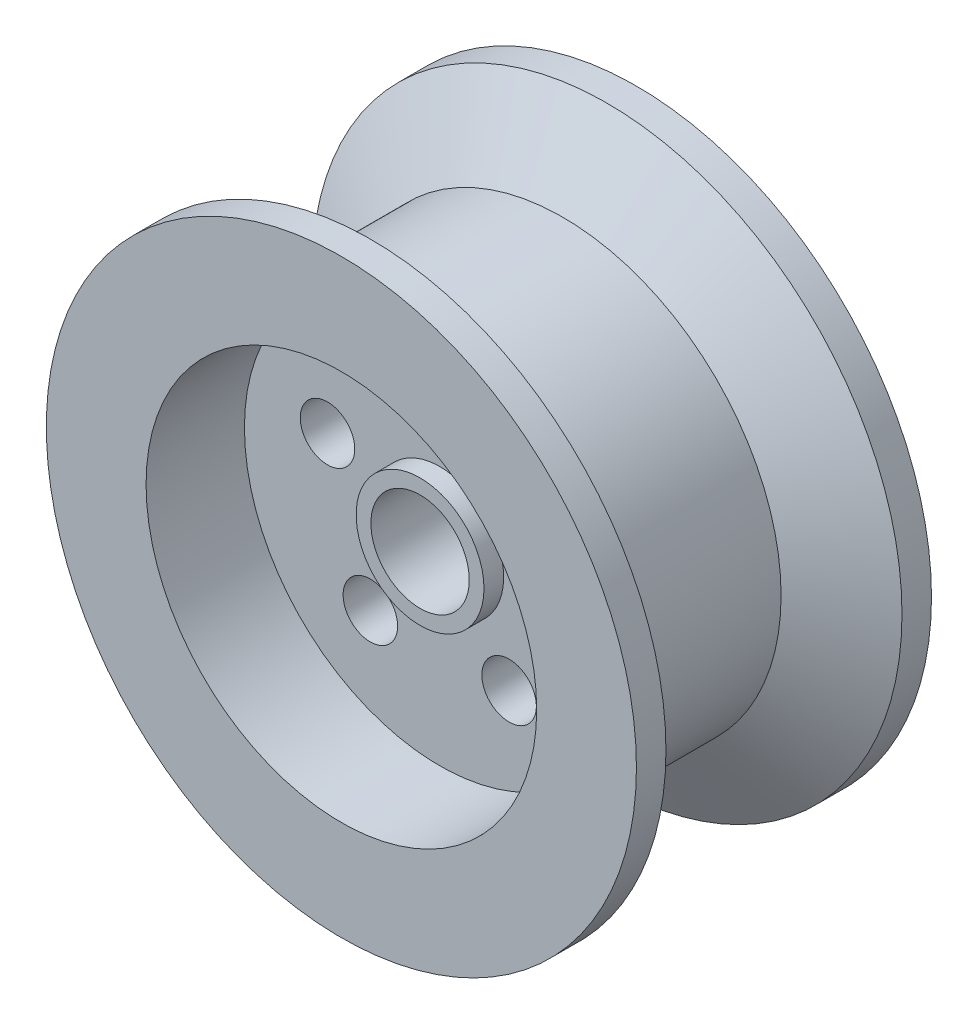
ISO-10303-21;
HEADER;
FILE_DESCRIPTION(('STEP AP214'),'2;1');
FILE_NAME('part.step','',(''),(''),'','','');
FILE_SCHEMA(('AUTOMOTIVE_DESIGN { 1 0 10303 214 1 1 1 1 }'));
ENDSEC;
DATA;
#1=APPLICATION_CONTEXT('core data for automotive mechanical design processes');
#2=APPLICATION_PROTOCOL_DEFINITION('international standard','automotive_design',2000,#1);
#3=PRODUCT_CONTEXT('',#1,'mechanical');
#4=PRODUCT('Part','Part','',(#3));
#5=PRODUCT_RELATED_PRODUCT_CATEGORY('part','',(#4));
#6=PRODUCT_DEFINITION_FORMATION('','',#4);
#7=PRODUCT_DEFINITION_CONTEXT('part definition',#1,'design');
#8=PRODUCT_DEFINITION('design','',#6,#7);
#9=PRODUCT_DEFINITION_SHAPE('','',#8);
#10=(LENGTH_UNIT() NAMED_UNIT(*) SI_UNIT(.MILLI.,.METRE.));
#11=(NAMED_UNIT(*) PLANE_ANGLE_UNIT() SI_UNIT($,.RADIAN.));
#12=(NAMED_UNIT(*) SI_UNIT($,.STERADIAN.) SOLID_ANGLE_UNIT());
#13=UNCERTAINTY_MEASURE_WITH_UNIT(LENGTH_MEASURE(1.E-05),#10,'distance_accuracy_value','');
#14=(GEOMETRIC_REPRESENTATION_CONTEXT(3) GLOBAL_UNCERTAINTY_ASSIGNED_CONTEXT((#13)) GLOBAL_UNIT_ASSIGNED_CONTEXT((#10,
#11,#12)) REPRESENTATION_CONTEXT('',''));
#15=CARTESIAN_POINT('',(0.,0.,0.));
#16=DIRECTION('',(0.,0.,1.));
#17=DIRECTION('',(1.,0.,0.));
#18=AXIS2_PLACEMENT_3D('',#15,#16,#17);
#19=CARTESIAN_POINT('',(0.,0.,30.));
#20=DIRECTION('',(0.,0.,-1.));
#21=DIRECTION('',(-1.,0.,0.));
#22=AXIS2_PLACEMENT_3D('',#19,#20,#21);
#23=CYLINDRICAL_SURFACE('',#22,30.);
#24=CARTESIAN_POINT('',(0.,0.,3.));
#25=DIRECTION('',(0.,0.,1.));
#26=DIRECTION('',(1.,0.,0.));
#27=AXIS2_PLACEMENT_3D('',#24,#25,#26);
#28=CIRCLE('',#27,30.);
#29=CARTESIAN_POINT('',(30.,0.,3.));
#30=VERTEX_POINT('',#29);
#31=EDGE_CURVE('E95',#30,#30,#28,.T.);
#32=ORIENTED_EDGE('',*,*,#31,.F.);
#33=EDGE_LOOP('',(#32));
#34=FACE_BOUND('',#33,.T.);
#35=CARTESIAN_POINT('',(0.,0.,0.));
#36=DIRECTION('',(0.,0.,1.));
#37=DIRECTION('',(1.,0.,0.));
#38=AXIS2_PLACEMENT_3D('',#35,#36,#37);
#39=CIRCLE('',#38,30.);
#40=CARTESIAN_POINT('',(30.,0.,0.));
#41=VERTEX_POINT('',#40);
#42=EDGE_CURVE('E44',#41,#41,#39,.T.);
#43=ORIENTED_EDGE('',*,*,#42,.T.);
#44=EDGE_LOOP('',(#43));
#45=FACE_BOUND('',#44,.T.);
#46=ADVANCED_FACE('F33',(#34,#45),#23,.T.);
#47=CARTESIAN_POINT('',(0.,0.,30.));
#48=DIRECTION('',(0.,0.,-1.));
#49=DIRECTION('',(-1.,0.,0.));
#50=AXIS2_PLACEMENT_3D('',#47,#48,#49);
#51=CYLINDRICAL_SURFACE('',#50,5.);
#52=CARTESIAN_POINT('',(0.,0.,22.));
#53=DIRECTION('',(0.,0.,1.));
#54=DIRECTION('',(1.,0.,0.));
#55=AXIS2_PLACEMENT_3D('',#52,#53,#54);
#56=CIRCLE('',#55,5.);
#57=CARTESIAN_POINT('',(5.,0.,22.));
#58=VERTEX_POINT('',#57);
#59=EDGE_CURVE('E92',#58,#58,#56,.T.);
#60=ORIENTED_EDGE('',*,*,#59,.T.);
#61=EDGE_LOOP('',(#60));
#62=FACE_BOUND('',#61,.T.);
#63=CARTESIAN_POINT('',(0.,0.,0.));
#64=DIRECTION('',(0.,0.,1.));
#65=DIRECTION('',(1.,0.,0.));
#66=AXIS2_PLACEMENT_3D('',#63,#64,#65);
#67=CIRCLE('',#66,5.);
#68=CARTESIAN_POINT('',(5.,0.,0.));
#69=VERTEX_POINT('',#68);
#70=EDGE_CURVE('E49',#69,#69,#67,.T.);
#71=ORIENTED_EDGE('',*,*,#70,.F.);
#72=EDGE_LOOP('',(#71));
#73=FACE_BOUND('',#72,.T.);
#74=ADVANCED_FACE('F131',(#62,#73),#51,.F.);
#75=CARTESIAN_POINT('',(0.,0.,30.));
#76=DIRECTION('',(0.,0.,1.));
#77=DIRECTION('',(1.,0.,0.));
#78=AXIS2_PLACEMENT_3D('',#75,#76,#77);
#79=PLANE('',#78);
#80=CARTESIAN_POINT('',(0.,0.,30.));
#81=DIRECTION('',(0.,0.,1.));
#82=DIRECTION('',(1.,0.,0.));
#83=AXIS2_PLACEMENT_3D('',#80,#81,#82);
#84=CIRCLE('',#83,19.858143103124);
#85=CARTESIAN_POINT('',(19.858143103124,0.,30.));
#86=VERTEX_POINT('',#85);
#87=EDGE_CURVE('E54',#86,#86,#84,.T.);
#88=ORIENTED_EDGE('',*,*,#87,.F.);
#89=EDGE_LOOP('',(#88));
#90=FACE_BOUND('',#89,.T.);
#91=CARTESIAN_POINT('',(0.,0.,30.));
#92=DIRECTION('',(0.,0.,1.));
#93=DIRECTION('',(1.,0.,0.));
#94=AXIS2_PLACEMENT_3D('',#91,#92,#93);
#95=CIRCLE('',#94,30.);
#96=CARTESIAN_POINT('',(30.,0.,30.));
#97=VERTEX_POINT('',#96);
#98=EDGE_CURVE('E40',#97,#97,#95,.T.);
#99=ORIENTED_EDGE('',*,*,#98,.T.);
#100=EDGE_LOOP('',(#99));
#101=FACE_BOUND('',#100,.T.);
#102=ADVANCED_FACE('F137',(#90,#101),#79,.T.);
#103=CARTESIAN_POINT('',(0.,0.,0.));
#104=DIRECTION('',(0.,0.,1.));
#105=DIRECTION('',(1.,0.,0.));
#106=AXIS2_PLACEMENT_3D('',#103,#104,#105);
#107=PLANE('',#106);
#108=CARTESIAN_POINT('',(0.,12.,0.));
#109=DIRECTION('',(0.,0.,1.));
#110=DIRECTION('',(1.,0.,0.));
#111=AXIS2_PLACEMENT_3D('',#108,#109,#110);
#112=CIRCLE('',#111,2.77136827470584);
#113=CARTESIAN_POINT('',(2.77136827470584,12.,0.));
#114=VERTEX_POINT('',#113);
#115=EDGE_CURVE('E57',#114,#114,#112,.T.);
#116=ORIENTED_EDGE('',*,*,#115,.T.);
#117=EDGE_LOOP('',(#116));
#118=FACE_BOUND('',#117,.T.);
#119=CARTESIAN_POINT('',(11.4126781955422,3.70820393249985,0.));
#120=DIRECTION('',(0.,0.,1.));
#121=DIRECTION('',(1.,0.,0.));
#122=AXIS2_PLACEMENT_3D('',#119,#120,#121);
#123=CIRCLE('',#122,2.77136827470607);
#124=CARTESIAN_POINT('',(14.1840464702483,3.70820393249985,0.));
#125=VERTEX_POINT('',#124);
#126=EDGE_CURVE('E82',#125,#125,#123,.T.);
#127=ORIENTED_EDGE('',*,*,#126,.T.);
#128=EDGE_LOOP('',(#127));
#129=FACE_BOUND('',#128,.T.);
#130=CARTESIAN_POINT('',(7.0534230275106,-9.70820393249907,0.));
#131=DIRECTION('',(0.,0.,1.));
#132=DIRECTION('',(1.,0.,0.));
#133=AXIS2_PLACEMENT_3D('',#130,#131,#132);
#134=CIRCLE('',#133,2.7713682747067);
#135=CARTESIAN_POINT('',(9.8247913022173,-9.70820393249907,0.));
#136=VERTEX_POINT('',#135);
#137=EDGE_CURVE('E76',#136,#136,#134,.T.);
#138=ORIENTED_EDGE('',*,*,#137,.T.);
#139=EDGE_LOOP('',(#138));
#140=FACE_BOUND('',#139,.T.);
#141=CARTESIAN_POINT('',(-7.05342302750876,-9.70820393249967,0.));
#142=DIRECTION('',(0.,0.,1.));
#143=DIRECTION('',(1.,0.,0.));
#144=AXIS2_PLACEMENT_3D('',#141,#142,#143);
#145=CIRCLE('',#144,2.77136827470691);
#146=CARTESIAN_POINT('',(-4.28205475280185,-9.70820393249967,0.));
#147=VERTEX_POINT('',#146);
#148=EDGE_CURVE('E70',#147,#147,#145,.T.);
#149=ORIENTED_EDGE('',*,*,#148,.T.);
#150=EDGE_LOOP('',(#149));
#151=FACE_BOUND('',#150,.T.);
#152=CARTESIAN_POINT('',(-11.4126781955415,3.70820393249888,0.));
#153=DIRECTION('',(0.,0.,1.));
#154=DIRECTION('',(1.,0.,0.));
#155=AXIS2_PLACEMENT_3D('',#152,#153,#154);
#156=CIRCLE('',#155,2.77136827470645);
#157=CARTESIAN_POINT('',(-8.64130992083504,3.70820393249888,0.));
#158=VERTEX_POINT('',#157);
#159=EDGE_CURVE('E63',#158,#158,#156,.T.);
#160=ORIENTED_EDGE('',*,*,#159,.T.);
#161=EDGE_LOOP('',(#160));
#162=FACE_BOUND('',#161,.T.);
#163=ORIENTED_EDGE('',*,*,#42,.F.);
#164=EDGE_LOOP('',(#163));
#165=FACE_BOUND('',#164,.T.);
#166=ORIENTED_EDGE('',*,*,#70,.T.);
#167=EDGE_LOOP('',(#166));
#168=FACE_BOUND('',#167,.T.);
#169=ADVANCED_FACE('F134',(#118,#129,#140,#151,#162,#165,#168),#107,.F.);
#170=CARTESIAN_POINT('',(0.,0.,27.));
#171=DIRECTION('',(0.,0.,1.));
#172=DIRECTION('',(1.,0.,0.));
#173=AXIS2_PLACEMENT_3D('',#170,#171,#172);
#174=CIRCLE('',#173,30.);
#175=CARTESIAN_POINT('',(30.,0.,27.));
#176=VERTEX_POINT('',#175);
#177=EDGE_CURVE('E104',#176,#176,#174,.T.);
#178=ORIENTED_EDGE('',*,*,#177,.T.);
#179=EDGE_LOOP('',(#178));
#180=FACE_BOUND('',#179,.T.);
#181=ORIENTED_EDGE('',*,*,#98,.F.);
#182=EDGE_LOOP('',(#181));
#183=FACE_BOUND('',#182,.T.);
#184=ADVANCED_FACE('F35',(#180,#183),#23,.T.);
#185=CARTESIAN_POINT('',(0.,0.,20.));
#186=DIRECTION('',(0.,0.,1.));
#187=DIRECTION('',(1.,0.,0.));
#188=AXIS2_PLACEMENT_3D('',#185,#186,#187);
#189=CYLINDRICAL_SURFACE('',#188,19.858143103124);
#190=CARTESIAN_POINT('',(0.,0.,20.));
#191=DIRECTION('',(0.,0.,1.));
#192=DIRECTION('',(1.,0.,0.));
#193=AXIS2_PLACEMENT_3D('',#190,#191,#192);
#194=CIRCLE('',#193,19.858143103124);
#195=CARTESIAN_POINT('',(19.858143103124,0.,20.));
#196=VERTEX_POINT('',#195);
#197=EDGE_CURVE('E53',#196,#196,#194,.T.);
#198=ORIENTED_EDGE('',*,*,#197,.F.);
#199=EDGE_LOOP('',(#198));
#200=FACE_BOUND('',#199,.T.);
#201=ORIENTED_EDGE('',*,*,#87,.T.);
#202=EDGE_LOOP('',(#201));
#203=FACE_BOUND('',#202,.T.);
#204=ADVANCED_FACE('F150',(#200,#203),#189,.F.);
#205=CARTESIAN_POINT('',(0.,0.,20.));
#206=DIRECTION('',(0.,0.,1.));
#207=DIRECTION('',(1.,0.,0.));
#208=AXIS2_PLACEMENT_3D('',#205,#206,#207);
#209=PLANE('',#208);
#210=CARTESIAN_POINT('',(0.,0.,20.));
#211=DIRECTION('',(0.,0.,1.));
#212=DIRECTION('',(1.,0.,0.));
#213=AXIS2_PLACEMENT_3D('',#210,#211,#212);
#214=CIRCLE('',#213,6.5);
#215=CARTESIAN_POINT('',(6.5,0.,20.));
#216=VERTEX_POINT('',#215);
#217=EDGE_CURVE('E10',#216,#216,#214,.T.);
#218=ORIENTED_EDGE('',*,*,#217,.F.);
#219=EDGE_LOOP('',(#218));
#220=FACE_BOUND('',#219,.T.);
#221=CARTESIAN_POINT('',(0.,12.,20.));
#222=DIRECTION('',(0.,0.,1.));
#223=DIRECTION('',(1.,0.,0.));
#224=AXIS2_PLACEMENT_3D('',#221,#222,#223);
#225=CIRCLE('',#224,2.77136827470584);
#226=CARTESIAN_POINT('',(2.77136827470584,12.,20.));
#227=VERTEX_POINT('',#226);
#228=EDGE_CURVE('E85',#227,#227,#225,.T.);
#229=ORIENTED_EDGE('',*,*,#228,.F.);
#230=EDGE_LOOP('',(#229));
#231=FACE_BOUND('',#230,.T.);
#232=CARTESIAN_POINT('',(11.4126781955422,3.70820393249985,20.));
#233=DIRECTION('',(0.,0.,1.));
#234=DIRECTION('',(1.,0.,0.));
#235=AXIS2_PLACEMENT_3D('',#232,#233,#234);
#236=CIRCLE('',#235,2.77136827470607);
#237=CARTESIAN_POINT('',(14.1840464702483,3.70820393249985,20.));
#238=VERTEX_POINT('',#237);
#239=EDGE_CURVE('E79',#238,#238,#236,.T.);
#240=ORIENTED_EDGE('',*,*,#239,.F.);
#241=EDGE_LOOP('',(#240));
#242=FACE_BOUND('',#241,.T.);
#243=CARTESIAN_POINT('',(7.0534230275106,-9.70820393249907,20.));
#244=DIRECTION('',(0.,0.,1.));
#245=DIRECTION('',(1.,0.,0.));
#246=AXIS2_PLACEMENT_3D('',#243,#244,#245);
#247=CIRCLE('',#246,2.7713682747067);
#248=CARTESIAN_POINT('',(9.8247913022173,-9.70820393249907,20.));
#249=VERTEX_POINT('',#248);
#250=EDGE_CURVE('E73',#249,#249,#247,.T.);
#251=ORIENTED_EDGE('',*,*,#250,.F.);
#252=EDGE_LOOP('',(#251));
#253=FACE_BOUND('',#252,.T.);
#254=CARTESIAN_POINT('',(-7.05342302750876,-9.70820393249967,20.));
#255=DIRECTION('',(0.,0.,1.));
#256=DIRECTION('',(1.,0.,0.));
#257=AXIS2_PLACEMENT_3D('',#254,#255,#256);
#258=CIRCLE('',#257,2.77136827470691);
#259=CARTESIAN_POINT('',(-4.28205475280185,-9.70820393249967,20.));
#260=VERTEX_POINT('',#259);
#261=EDGE_CURVE('E67',#260,#260,#258,.T.);
#262=ORIENTED_EDGE('',*,*,#261,.F.);
#263=EDGE_LOOP('',(#262));
#264=FACE_BOUND('',#263,.T.);
#265=CARTESIAN_POINT('',(-11.4126781955415,3.70820393249888,20.));
#266=DIRECTION('',(0.,0.,1.));
#267=DIRECTION('',(1.,0.,0.));
#268=AXIS2_PLACEMENT_3D('',#265,#266,#267);
#269=CIRCLE('',#268,2.77136827470645);
#270=CARTESIAN_POINT('',(-8.64130992083504,3.70820393249888,20.));
#271=VERTEX_POINT('',#270);
#272=EDGE_CURVE('E60',#271,#271,#269,.T.);
#273=ORIENTED_EDGE('',*,*,#272,.F.);
#274=EDGE_LOOP('',(#273));
#275=FACE_BOUND('',#274,.T.);
#276=ORIENTED_EDGE('',*,*,#197,.T.);
#277=EDGE_LOOP('',(#276));
#278=FACE_BOUND('',#277,.T.);
#279=ADVANCED_FACE('F153',(#220,#231,#242,#253,#264,#275,#278),#209,.T.);
#280=CARTESIAN_POINT('',(-11.4126781955415,3.70820393249888,0.));
#281=DIRECTION('',(0.,0.,1.));
#282=DIRECTION('',(1.,0.,0.));
#283=AXIS2_PLACEMENT_3D('',#280,#281,#282);
#284=CYLINDRICAL_SURFACE('',#283,2.77136827470645);
#285=ORIENTED_EDGE('',*,*,#159,.F.);
#286=EDGE_LOOP('',(#285));
#287=FACE_BOUND('',#286,.T.);
#288=ORIENTED_EDGE('',*,*,#272,.T.);
#289=EDGE_LOOP('',(#288));
#290=FACE_BOUND('',#289,.T.);
#291=ADVANCED_FACE('F157',(#287,#290),#284,.F.);
#292=CARTESIAN_POINT('',(-7.05342302750876,-9.70820393249967,0.));
#293=DIRECTION('',(0.,0.,1.));
#294=DIRECTION('',(1.,0.,0.));
#295=AXIS2_PLACEMENT_3D('',#292,#293,#294);
#296=CYLINDRICAL_SURFACE('',#295,2.77136827470691);
#297=ORIENTED_EDGE('',*,*,#148,.F.);
#298=EDGE_LOOP('',(#297));
#299=FACE_BOUND('',#298,.T.);
#300=ORIENTED_EDGE('',*,*,#261,.T.);
#301=EDGE_LOOP('',(#300));
#302=FACE_BOUND('',#301,.T.);
#303=ADVANCED_FACE('F161',(#299,#302),#296,.F.);
#304=CARTESIAN_POINT('',(7.0534230275106,-9.70820393249907,0.));
#305=DIRECTION('',(0.,0.,1.));
#306=DIRECTION('',(1.,0.,0.));
#307=AXIS2_PLACEMENT_3D('',#304,#305,#306);
#308=CYLINDRICAL_SURFACE('',#307,2.7713682747067);
#309=ORIENTED_EDGE('',*,*,#137,.F.);
#310=EDGE_LOOP('',(#309));
#311=FACE_BOUND('',#310,.T.);
#312=ORIENTED_EDGE('',*,*,#250,.T.);
#313=EDGE_LOOP('',(#312));
#314=FACE_BOUND('',#313,.T.);
#315=ADVANCED_FACE('F165',(#311,#314),#308,.F.);
#316=CARTESIAN_POINT('',(11.4126781955422,3.70820393249985,0.));
#317=DIRECTION('',(0.,0.,1.));
#318=DIRECTION('',(1.,0.,0.));
#319=AXIS2_PLACEMENT_3D('',#316,#317,#318);
#320=CYLINDRICAL_SURFACE('',#319,2.77136827470607);
#321=ORIENTED_EDGE('',*,*,#126,.F.);
#322=EDGE_LOOP('',(#321));
#323=FACE_BOUND('',#322,.T.);
#324=ORIENTED_EDGE('',*,*,#239,.T.);
#325=EDGE_LOOP('',(#324));
#326=FACE_BOUND('',#325,.T.);
#327=ADVANCED_FACE('F169',(#323,#326),#320,.F.);
#328=CARTESIAN_POINT('',(0.,12.,0.));
#329=DIRECTION('',(0.,0.,1.));
#330=DIRECTION('',(1.,0.,0.));
#331=AXIS2_PLACEMENT_3D('',#328,#329,#330);
#332=CYLINDRICAL_SURFACE('',#331,2.77136827470584);
#333=ORIENTED_EDGE('',*,*,#115,.F.);
#334=EDGE_LOOP('',(#333));
#335=FACE_BOUND('',#334,.T.);
#336=ORIENTED_EDGE('',*,*,#228,.T.);
#337=EDGE_LOOP('',(#336));
#338=FACE_BOUND('',#337,.T.);
#339=ADVANCED_FACE('F173',(#335,#338),#332,.F.);
#340=CARTESIAN_POINT('',(0.,0.,13.));
#341=DIRECTION('',(0.,0.,1.));
#342=DIRECTION('',(1.,0.,0.));
#343=AXIS2_PLACEMENT_3D('',#340,#341,#342);
#344=CYLINDRICAL_SURFACE('',#343,6.5);
#345=ORIENTED_EDGE('',*,*,#217,.T.);
#346=EDGE_LOOP('',(#345));
#347=FACE_BOUND('',#346,.T.);
#348=CARTESIAN_POINT('',(0.,0.,22.));
#349=DIRECTION('',(0.,0.,1.));
#350=DIRECTION('',(1.,0.,0.));
#351=AXIS2_PLACEMENT_3D('',#348,#349,#350);
#352=CIRCLE('',#351,6.5);
#353=CARTESIAN_POINT('',(6.5,0.,22.));
#354=VERTEX_POINT('',#353);
#355=EDGE_CURVE('E64',#354,#354,#352,.T.);
#356=ORIENTED_EDGE('',*,*,#355,.F.);
#357=EDGE_LOOP('',(#356));
#358=FACE_BOUND('',#357,.T.);
#359=ADVANCED_FACE('F177',(#347,#358),#344,.T.);
#360=CARTESIAN_POINT('',(0.,0.,22.));
#361=DIRECTION('',(0.,0.,1.));
#362=DIRECTION('',(1.,0.,0.));
#363=AXIS2_PLACEMENT_3D('',#360,#361,#362);
#364=PLANE('',#363);
#365=ORIENTED_EDGE('',*,*,#355,.T.);
#366=EDGE_LOOP('',(#365));
#367=FACE_BOUND('',#366,.T.);
#368=ORIENTED_EDGE('',*,*,#59,.F.);
#369=EDGE_LOOP('',(#368));
#370=FACE_BOUND('',#369,.T.);
#371=ADVANCED_FACE('F125',(#367,#370),#364,.T.);
#372=CARTESIAN_POINT('',(0.,0.,3.));
#373=DIRECTION('',(0.,0.,-1.));
#374=DIRECTION('',(-1.,0.,0.));
#375=AXIS2_PLACEMENT_3D('',#372,#373,#374);
#376=CONICAL_SURFACE('',#375,30.,1.04719755119659);
#377=CARTESIAN_POINT('',(0.,0.,7.5));
#378=DIRECTION('',(0.,0.,1.));
#379=DIRECTION('',(1.,0.,0.));
#380=AXIS2_PLACEMENT_3D('',#377,#378,#379);
#381=CIRCLE('',#380,22.2057713659401);
#382=CARTESIAN_POINT('',(22.2057713659401,0.,7.5));
#383=VERTEX_POINT('',#382);
#384=EDGE_CURVE('E98',#383,#383,#381,.T.);
#385=ORIENTED_EDGE('',*,*,#384,.F.);
#386=EDGE_LOOP('',(#385));
#387=FACE_BOUND('',#386,.T.);
#388=ORIENTED_EDGE('',*,*,#31,.T.);
#389=EDGE_LOOP('',(#388));
#390=FACE_BOUND('',#389,.T.);
#391=ADVANCED_FACE('F119',(#387,#390),#376,.T.);
#392=CARTESIAN_POINT('',(0.,0.,0.));
#393=DIRECTION('',(0.,0.,1.));
#394=DIRECTION('',(1.,0.,0.));
#395=AXIS2_PLACEMENT_3D('',#392,#393,#394);
#396=CYLINDRICAL_SURFACE('',#395,22.2057713659401);
#397=CARTESIAN_POINT('',(0.,0.,22.5));
#398=DIRECTION('',(0.,0.,1.));
#399=DIRECTION('',(1.,0.,0.));
#400=AXIS2_PLACEMENT_3D('',#397,#398,#399);
#401=CIRCLE('',#400,22.2057713659402);
#402=CARTESIAN_POINT('',(22.2057713659402,0.,22.5));
#403=VERTEX_POINT('',#402);
#404=EDGE_CURVE('E101',#403,#403,#401,.T.);
#405=ORIENTED_EDGE('',*,*,#404,.F.);
#406=EDGE_LOOP('',(#405));
#407=FACE_BOUND('',#406,.T.);
#408=ORIENTED_EDGE('',*,*,#384,.T.);
#409=EDGE_LOOP('',(#408));
#410=FACE_BOUND('',#409,.T.);
#411=ADVANCED_FACE('F113',(#407,#410),#396,.T.);
#412=CARTESIAN_POINT('',(0.,0.,22.5));
#413=DIRECTION('',(0.,0.,1.));
#414=DIRECTION('',(1.,0.,0.));
#415=AXIS2_PLACEMENT_3D('',#412,#413,#414);
#416=CONICAL_SURFACE('',#415,22.2057713659402,1.04719755119659);
#417=ORIENTED_EDGE('',*,*,#177,.F.);
#418=EDGE_LOOP('',(#417));
#419=FACE_BOUND('',#418,.T.);
#420=ORIENTED_EDGE('',*,*,#404,.T.);
#421=EDGE_LOOP('',(#420));
#422=FACE_BOUND('',#421,.T.);
#423=ADVANCED_FACE('F110',(#419,#422),#416,.T.);
#424=CLOSED_SHELL('',(#46,#74,#102,#169,#184,#204,#279,#291,#303,#315,#327,#339,#359,#371,#391,
#411,#423));
#425=MANIFOLD_SOLID_BREP('B2',#424);
#426=ADVANCED_BREP_SHAPE_REPRESENTATION('',(#18,#425),#14);
#427=SHAPE_DEFINITION_REPRESENTATION(#9,#426);
ENDSEC;
END-ISO-10303-21;
